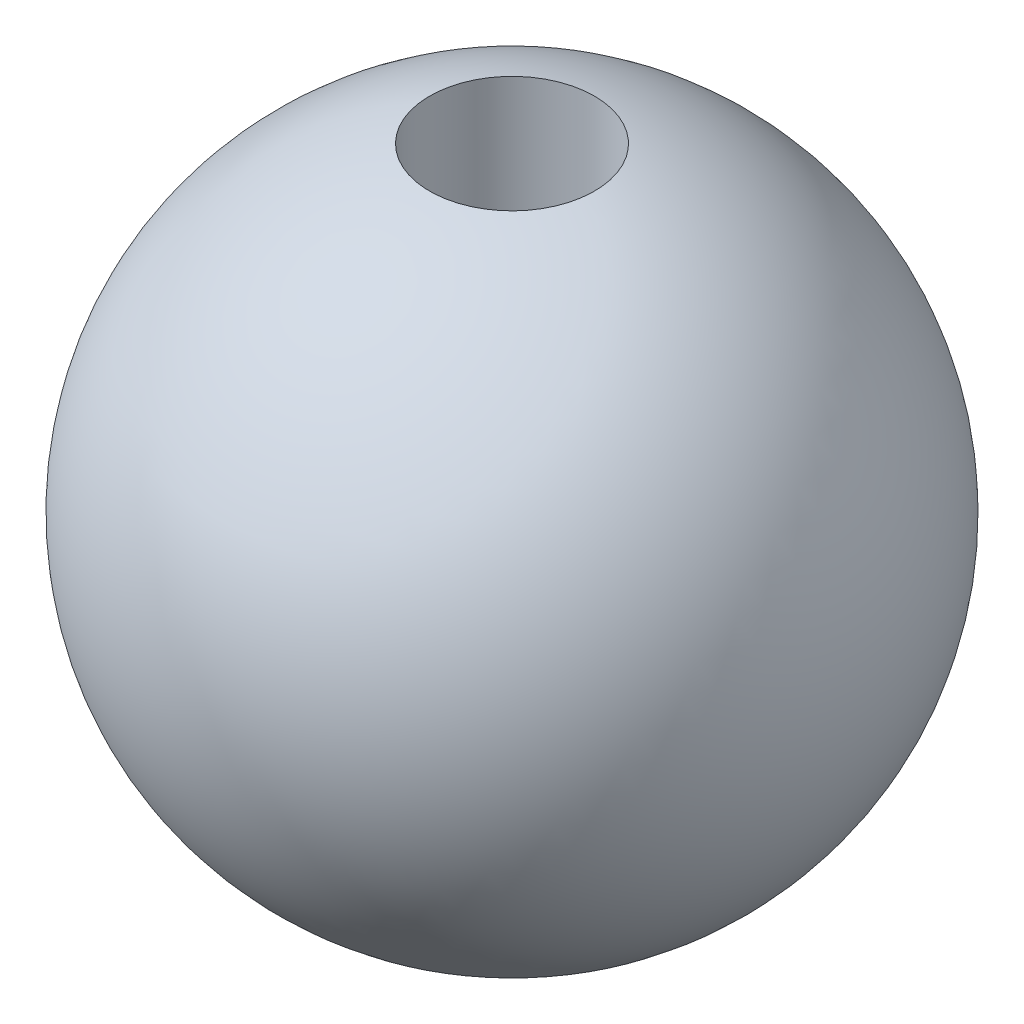
ISO-10303-21;
HEADER;
FILE_DESCRIPTION(('STEP AP214'),'2;1');
FILE_NAME('part.step','',(''),(''),'','','');
FILE_SCHEMA(('AUTOMOTIVE_DESIGN { 1 0 10303 214 1 1 1 1 }'));
ENDSEC;
DATA;
#1=APPLICATION_CONTEXT('core data for automotive mechanical design processes');
#2=APPLICATION_PROTOCOL_DEFINITION('international standard','automotive_design',2000,#1);
#3=PRODUCT_CONTEXT('',#1,'mechanical');
#4=PRODUCT('Part','Part','',(#3));
#5=PRODUCT_RELATED_PRODUCT_CATEGORY('part','',(#4));
#6=PRODUCT_DEFINITION_FORMATION('','',#4);
#7=PRODUCT_DEFINITION_CONTEXT('part definition',#1,'design');
#8=PRODUCT_DEFINITION('design','',#6,#7);
#9=PRODUCT_DEFINITION_SHAPE('','',#8);
#10=(LENGTH_UNIT() NAMED_UNIT(*) SI_UNIT(.MILLI.,.METRE.));
#11=(NAMED_UNIT(*) PLANE_ANGLE_UNIT() SI_UNIT($,.RADIAN.));
#12=(NAMED_UNIT(*) SI_UNIT($,.STERADIAN.) SOLID_ANGLE_UNIT());
#13=UNCERTAINTY_MEASURE_WITH_UNIT(LENGTH_MEASURE(1.E-05),#10,'distance_accuracy_value','');
#14=(GEOMETRIC_REPRESENTATION_CONTEXT(3) GLOBAL_UNCERTAINTY_ASSIGNED_CONTEXT((#13)) GLOBAL_UNIT_ASSIGNED_CONTEXT((#10,
#11,#12)) REPRESENTATION_CONTEXT('',''));
#15=CARTESIAN_POINT('',(0.,0.,0.));
#16=DIRECTION('',(0.,0.,1.));
#17=DIRECTION('',(1.,0.,0.));
#18=AXIS2_PLACEMENT_3D('',#15,#16,#17);
#19=CARTESIAN_POINT('',(0.,0.,0.));
#20=DIRECTION('',(0.,0.,-1.));
#21=DIRECTION('',(1.,0.,0.));
#22=AXIS2_PLACEMENT_3D('',#19,#20,#21);
#23=SPHERICAL_SURFACE('',#22,6.);
#24=CARTESIAN_POINT('',(0.,0.,0.));
#25=DIRECTION('',(0.,-1.,0.));
#26=DIRECTION('',(0.,0.,-1.));
#27=AXIS2_PLACEMENT_3D('',#24,#25,#26);
#28=SPHERICAL_SURFACE('',#27,6.);
#29=CARTESIAN_POINT('',(0.,5.80947501931113,0.));
#30=DIRECTION('',(0.,-1.,0.));
#31=DIRECTION('',(0.,0.,-1.));
#32=AXIS2_PLACEMENT_3D('',#29,#30,#31);
#33=CIRCLE('',#32,1.5);
#34=CARTESIAN_POINT('',(0.,5.80947501931113,-1.5));
#35=VERTEX_POINT('',#34);
#36=EDGE_CURVE('E10',#35,#35,#33,.F.);
#37=ORIENTED_EDGE('',*,*,#36,.F.);
#38=EDGE_LOOP('',(#37));
#39=FACE_BOUND('',#38,.T.);
#40=ADVANCED_FACE('F30',(#39),#28,.T.);
#41=CARTESIAN_POINT('',(0.,6.,0.));
#42=DIRECTION('',(0.,-1.,0.));
#43=DIRECTION('',(0.,0.,-1.));
#44=AXIS2_PLACEMENT_3D('',#41,#42,#43);
#45=CYLINDRICAL_SURFACE('',#44,1.5);
#46=CARTESIAN_POINT('',(0.,0.,0.));
#47=DIRECTION('',(0.,1.,0.));
#48=DIRECTION('',(0.,0.,1.));
#49=AXIS2_PLACEMENT_3D('',#46,#47,#48);
#50=CIRCLE('',#49,1.5);
#51=CARTESIAN_POINT('',(0.,0.,1.5));
#52=VERTEX_POINT('',#51);
#53=EDGE_CURVE('E36',#52,#52,#50,.T.);
#54=ORIENTED_EDGE('',*,*,#53,.F.);
#55=EDGE_LOOP('',(#54));
#56=FACE_BOUND('',#55,.T.);
#57=ORIENTED_EDGE('',*,*,#36,.T.);
#58=EDGE_LOOP('',(#57));
#59=FACE_BOUND('',#58,.T.);
#60=ADVANCED_FACE('F44',(#56,#59),#45,.F.);
#61=CARTESIAN_POINT('',(0.,0.,0.));
#62=DIRECTION('',(0.,1.,0.));
#63=DIRECTION('',(0.,0.,1.));
#64=AXIS2_PLACEMENT_3D('',#61,#62,#63);
#65=PLANE('',#64);
#66=ORIENTED_EDGE('',*,*,#53,.T.);
#67=EDGE_LOOP('',(#66));
#68=FACE_BOUND('',#67,.T.);
#69=ADVANCED_FACE('F42',(#68),#65,.T.);
#70=CLOSED_SHELL('',(#40,#60,#69));
#71=MANIFOLD_SOLID_BREP('B2',#70);
#72=ADVANCED_BREP_SHAPE_REPRESENTATION('',(#18,#71),#14);
#73=SHAPE_DEFINITION_REPRESENTATION(#9,#72);
ENDSEC;
END-ISO-10303-21;
